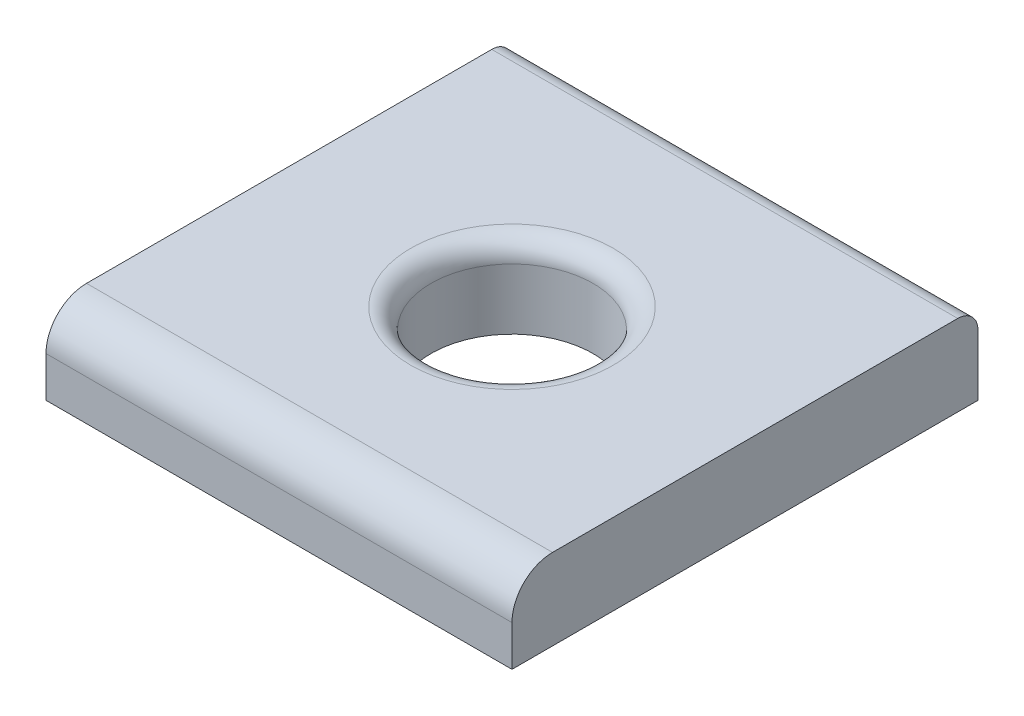
ISO-10303-21;
HEADER;
FILE_DESCRIPTION(('STEP AP214'),'2;1');
FILE_NAME('part.step','',(''),(''),'','','');
FILE_SCHEMA(('AUTOMOTIVE_DESIGN { 1 0 10303 214 1 1 1 1 }'));
ENDSEC;
DATA;
#1=APPLICATION_CONTEXT('core data for automotive mechanical design processes');
#2=APPLICATION_PROTOCOL_DEFINITION('international standard','automotive_design',2000,#1);
#3=PRODUCT_CONTEXT('',#1,'mechanical');
#4=PRODUCT('Part','Part','',(#3));
#5=PRODUCT_RELATED_PRODUCT_CATEGORY('part','',(#4));
#6=PRODUCT_DEFINITION_FORMATION('','',#4);
#7=PRODUCT_DEFINITION_CONTEXT('part definition',#1,'design');
#8=PRODUCT_DEFINITION('design','',#6,#7);
#9=PRODUCT_DEFINITION_SHAPE('','',#8);
#10=(LENGTH_UNIT() NAMED_UNIT(*) SI_UNIT(.MILLI.,.METRE.));
#11=(NAMED_UNIT(*) PLANE_ANGLE_UNIT() SI_UNIT($,.RADIAN.));
#12=(NAMED_UNIT(*) SI_UNIT($,.STERADIAN.) SOLID_ANGLE_UNIT());
#13=UNCERTAINTY_MEASURE_WITH_UNIT(LENGTH_MEASURE(1.E-05),#10,'distance_accuracy_value','');
#14=(GEOMETRIC_REPRESENTATION_CONTEXT(3) GLOBAL_UNCERTAINTY_ASSIGNED_CONTEXT((#13)) GLOBAL_UNIT_ASSIGNED_CONTEXT((#10,
#11,#12)) REPRESENTATION_CONTEXT('',''));
#15=CARTESIAN_POINT('',(0.,0.,0.));
#16=DIRECTION('',(0.,0.,1.));
#17=DIRECTION('',(1.,0.,0.));
#18=AXIS2_PLACEMENT_3D('',#15,#16,#17);
#19=CARTESIAN_POINT('',(5.75,2.,-5.75));
#20=DIRECTION('',(-1.,0.,0.));
#21=DIRECTION('',(0.,0.,1.));
#22=AXIS2_PLACEMENT_3D('',#19,#20,#21);
#23=PLANE('',#22);
#24=DIRECTION('',(0.,-1.,0.));
#25=VECTOR('',#24,1.);
#26=CARTESIAN_POINT('',(5.75,2.,-5.75));
#27=LINE('',#26,#25);
#28=CARTESIAN_POINT('',(5.75,1.5,-5.75));
#29=VERTEX_POINT('',#28);
#30=CARTESIAN_POINT('',(5.75,0.,-5.75));
#31=VERTEX_POINT('',#30);
#32=EDGE_CURVE('E85',#29,#31,#27,.T.);
#33=ORIENTED_EDGE('',*,*,#32,.F.);
#34=CARTESIAN_POINT('',(5.75,1.5,-5.25));
#35=DIRECTION('',(-1.,0.,0.));
#36=DIRECTION('',(0.,0.,1.));
#37=AXIS2_PLACEMENT_3D('',#34,#35,#36);
#38=CIRCLE('',#37,0.5);
#39=CARTESIAN_POINT('',(5.75,2.,-5.25));
#40=VERTEX_POINT('',#39);
#41=EDGE_CURVE('E137',#29,#40,#38,.F.);
#42=ORIENTED_EDGE('',*,*,#41,.T.);
#43=DIRECTION('',(0.,0.,-1.));
#44=VECTOR('',#43,1.);
#45=CARTESIAN_POINT('',(5.75,2.,-5.75));
#46=LINE('',#45,#44);
#47=CARTESIAN_POINT('',(5.75,2.,4.75));
#48=VERTEX_POINT('',#47);
#49=EDGE_CURVE('E118',#48,#40,#46,.T.);
#50=ORIENTED_EDGE('',*,*,#49,.F.);
#51=CARTESIAN_POINT('',(5.75,1.,4.75));
#52=DIRECTION('',(-1.,0.,0.));
#53=DIRECTION('',(0.,0.,1.));
#54=AXIS2_PLACEMENT_3D('',#51,#52,#53);
#55=CIRCLE('',#54,1.);
#56=CARTESIAN_POINT('',(5.75,1.,5.75));
#57=VERTEX_POINT('',#56);
#58=EDGE_CURVE('E125',#48,#57,#55,.F.);
#59=ORIENTED_EDGE('',*,*,#58,.T.);
#60=DIRECTION('',(0.,-1.,0.));
#61=VECTOR('',#60,1.);
#62=CARTESIAN_POINT('',(5.75,2.,5.75));
#63=LINE('',#62,#61);
#64=CARTESIAN_POINT('',(5.75,0.,5.75));
#65=VERTEX_POINT('',#64);
#66=EDGE_CURVE('E105',#57,#65,#63,.T.);
#67=ORIENTED_EDGE('',*,*,#66,.T.);
#68=DIRECTION('',(0.,0.,-1.));
#69=VECTOR('',#68,1.);
#70=CARTESIAN_POINT('',(5.75,0.,-5.75));
#71=LINE('',#70,#69);
#72=EDGE_CURVE('E100',#65,#31,#71,.T.);
#73=ORIENTED_EDGE('',*,*,#72,.T.);
#74=EDGE_LOOP('',(#33,#42,#50,#59,#67,#73));
#75=FACE_BOUND('',#74,.T.);
#76=ADVANCED_FACE('F34',(#75),#23,.F.);
#77=CARTESIAN_POINT('',(-5.75,2.,-5.75));
#78=DIRECTION('',(0.,0.,1.));
#79=DIRECTION('',(1.,0.,0.));
#80=AXIS2_PLACEMENT_3D('',#77,#78,#79);
#81=PLANE('',#80);
#82=DIRECTION('',(0.,-1.,0.));
#83=VECTOR('',#82,1.);
#84=CARTESIAN_POINT('',(-5.75,2.,-5.75));
#85=LINE('',#84,#83);
#86=CARTESIAN_POINT('',(-5.75,1.5,-5.75));
#87=VERTEX_POINT('',#86);
#88=CARTESIAN_POINT('',(-5.75,0.,-5.75));
#89=VERTEX_POINT('',#88);
#90=EDGE_CURVE('E94',#87,#89,#85,.T.);
#91=ORIENTED_EDGE('',*,*,#90,.F.);
#92=DIRECTION('',(-1.,0.,0.));
#93=VECTOR('',#92,1.);
#94=CARTESIAN_POINT('',(5.75,1.5,-5.75));
#95=LINE('',#94,#93);
#96=EDGE_CURVE('E49',#87,#29,#95,.F.);
#97=ORIENTED_EDGE('',*,*,#96,.T.);
#98=ORIENTED_EDGE('',*,*,#32,.T.);
#99=DIRECTION('',(-1.,0.,0.));
#100=VECTOR('',#99,1.);
#101=CARTESIAN_POINT('',(-5.75,0.,-5.75));
#102=LINE('',#101,#100);
#103=EDGE_CURVE('E88',#31,#89,#102,.T.);
#104=ORIENTED_EDGE('',*,*,#103,.T.);
#105=EDGE_LOOP('',(#91,#97,#98,#104));
#106=FACE_BOUND('',#105,.T.);
#107=ADVANCED_FACE('F87',(#106),#81,.F.);
#108=CARTESIAN_POINT('',(-5.75,2.,-5.75));
#109=DIRECTION('',(1.,0.,0.));
#110=DIRECTION('',(0.,0.,-1.));
#111=AXIS2_PLACEMENT_3D('',#108,#109,#110);
#112=PLANE('',#111);
#113=DIRECTION('',(0.,0.,1.));
#114=VECTOR('',#113,1.);
#115=CARTESIAN_POINT('',(-5.75,2.,-5.75));
#116=LINE('',#115,#114);
#117=CARTESIAN_POINT('',(-5.75,2.,-5.25));
#118=VERTEX_POINT('',#117);
#119=CARTESIAN_POINT('',(-5.75,2.,4.75));
#120=VERTEX_POINT('',#119);
#121=EDGE_CURVE('E112',#118,#120,#116,.T.);
#122=ORIENTED_EDGE('',*,*,#121,.F.);
#123=CARTESIAN_POINT('',(-5.75,1.5,-5.25));
#124=DIRECTION('',(1.,0.,0.));
#125=DIRECTION('',(0.,0.,-1.));
#126=AXIS2_PLACEMENT_3D('',#123,#124,#125);
#127=CIRCLE('',#126,0.5);
#128=EDGE_CURVE('E57',#118,#87,#127,.F.);
#129=ORIENTED_EDGE('',*,*,#128,.T.);
#130=ORIENTED_EDGE('',*,*,#90,.T.);
#131=DIRECTION('',(0.,0.,1.));
#132=VECTOR('',#131,1.);
#133=CARTESIAN_POINT('',(-5.75,0.,-5.75));
#134=LINE('',#133,#132);
#135=CARTESIAN_POINT('',(-5.75,0.,5.75));
#136=VERTEX_POINT('',#135);
#137=EDGE_CURVE('E102',#89,#136,#134,.T.);
#138=ORIENTED_EDGE('',*,*,#137,.T.);
#139=DIRECTION('',(0.,-1.,0.));
#140=VECTOR('',#139,1.);
#141=CARTESIAN_POINT('',(-5.75,2.,5.75));
#142=LINE('',#141,#140);
#143=CARTESIAN_POINT('',(-5.75,1.,5.75));
#144=VERTEX_POINT('',#143);
#145=EDGE_CURVE('E120',#144,#136,#142,.T.);
#146=ORIENTED_EDGE('',*,*,#145,.F.);
#147=CARTESIAN_POINT('',(-5.75,1.,4.75));
#148=DIRECTION('',(1.,0.,0.));
#149=DIRECTION('',(0.,0.,-1.));
#150=AXIS2_PLACEMENT_3D('',#147,#148,#149);
#151=CIRCLE('',#150,1.);
#152=EDGE_CURVE('E129',#144,#120,#151,.F.);
#153=ORIENTED_EDGE('',*,*,#152,.T.);
#154=EDGE_LOOP('',(#122,#129,#130,#138,#146,#153));
#155=FACE_BOUND('',#154,.T.);
#156=ADVANCED_FACE('F158',(#155),#112,.F.);
#157=CARTESIAN_POINT('',(-5.75,2.,5.75));
#158=DIRECTION('',(0.,0.,-1.));
#159=DIRECTION('',(-1.,0.,0.));
#160=AXIS2_PLACEMENT_3D('',#157,#158,#159);
#161=PLANE('',#160);
#162=ORIENTED_EDGE('',*,*,#66,.F.);
#163=DIRECTION('',(1.,0.,0.));
#164=VECTOR('',#163,1.);
#165=CARTESIAN_POINT('',(-5.75,1.,5.75));
#166=LINE('',#165,#164);
#167=EDGE_CURVE('E127',#57,#144,#166,.F.);
#168=ORIENTED_EDGE('',*,*,#167,.T.);
#169=ORIENTED_EDGE('',*,*,#145,.T.);
#170=DIRECTION('',(1.,0.,0.));
#171=VECTOR('',#170,1.);
#172=CARTESIAN_POINT('',(-5.75,0.,5.75));
#173=LINE('',#172,#171);
#174=EDGE_CURVE('E116',#136,#65,#173,.T.);
#175=ORIENTED_EDGE('',*,*,#174,.T.);
#176=EDGE_LOOP('',(#162,#168,#169,#175));
#177=FACE_BOUND('',#176,.T.);
#178=ADVANCED_FACE('F173',(#177),#161,.F.);
#179=CARTESIAN_POINT('',(0.,2.,0.));
#180=DIRECTION('',(0.,1.,0.));
#181=DIRECTION('',(0.,0.,1.));
#182=AXIS2_PLACEMENT_3D('',#179,#180,#181);
#183=PLANE('',#182);
#184=CARTESIAN_POINT('',(0.,2.,0.));
#185=DIRECTION('',(0.,1.,0.));
#186=DIRECTION('',(0.,0.,1.));
#187=AXIS2_PLACEMENT_3D('',#184,#185,#186);
#188=CIRCLE('',#187,2.5);
#189=CARTESIAN_POINT('',(0.,2.,2.5));
#190=VERTEX_POINT('',#189);
#191=EDGE_CURVE('E11',#190,#190,#188,.F.);
#192=ORIENTED_EDGE('',*,*,#191,.T.);
#193=EDGE_LOOP('',(#192));
#194=FACE_BOUND('',#193,.T.);
#195=ORIENTED_EDGE('',*,*,#49,.T.);
#196=DIRECTION('',(-1.,0.,0.));
#197=VECTOR('',#196,1.);
#198=CARTESIAN_POINT('',(-5.75,2.,-5.25));
#199=LINE('',#198,#197);
#200=EDGE_CURVE('E132',#40,#118,#199,.T.);
#201=ORIENTED_EDGE('',*,*,#200,.T.);
#202=ORIENTED_EDGE('',*,*,#121,.T.);
#203=DIRECTION('',(1.,0.,0.));
#204=VECTOR('',#203,1.);
#205=CARTESIAN_POINT('',(5.75,2.,4.75));
#206=LINE('',#205,#204);
#207=EDGE_CURVE('E93',#120,#48,#206,.T.);
#208=ORIENTED_EDGE('',*,*,#207,.T.);
#209=EDGE_LOOP('',(#195,#201,#202,#208));
#210=FACE_BOUND('',#209,.T.);
#211=ADVANCED_FACE('F175',(#194,#210),#183,.T.);
#212=CARTESIAN_POINT('',(0.,0.,0.));
#213=DIRECTION('',(0.,1.,0.));
#214=DIRECTION('',(0.,0.,1.));
#215=AXIS2_PLACEMENT_3D('',#212,#213,#214);
#216=PLANE('',#215);
#217=CARTESIAN_POINT('',(0.,0.,0.));
#218=DIRECTION('',(0.,1.,0.));
#219=DIRECTION('',(0.,0.,1.));
#220=AXIS2_PLACEMENT_3D('',#217,#218,#219);
#221=CIRCLE('',#220,2.);
#222=CARTESIAN_POINT('',(0.,0.,2.));
#223=VERTEX_POINT('',#222);
#224=EDGE_CURVE('E107',#223,#223,#221,.T.);
#225=ORIENTED_EDGE('',*,*,#224,.T.);
#226=EDGE_LOOP('',(#225));
#227=FACE_BOUND('',#226,.T.);
#228=ORIENTED_EDGE('',*,*,#72,.F.);
#229=ORIENTED_EDGE('',*,*,#174,.F.);
#230=ORIENTED_EDGE('',*,*,#137,.F.);
#231=ORIENTED_EDGE('',*,*,#103,.F.);
#232=EDGE_LOOP('',(#228,#229,#230,#231));
#233=FACE_BOUND('',#232,.T.);
#234=ADVANCED_FACE('F98',(#227,#233),#216,.F.);
#235=CARTESIAN_POINT('',(0.,0.,0.));
#236=DIRECTION('',(0.,1.,0.));
#237=DIRECTION('',(0.,0.,1.));
#238=AXIS2_PLACEMENT_3D('',#235,#236,#237);
#239=CYLINDRICAL_SURFACE('',#238,2.);
#240=CARTESIAN_POINT('',(0.,1.5,0.));
#241=DIRECTION('',(0.,1.,0.));
#242=DIRECTION('',(0.,0.,1.));
#243=AXIS2_PLACEMENT_3D('',#240,#241,#242);
#244=CIRCLE('',#243,2.);
#245=CARTESIAN_POINT('',(0.,1.5,2.));
#246=VERTEX_POINT('',#245);
#247=EDGE_CURVE('E42',#246,#246,#244,.T.);
#248=ORIENTED_EDGE('',*,*,#247,.T.);
#249=EDGE_LOOP('',(#248));
#250=FACE_BOUND('',#249,.T.);
#251=ORIENTED_EDGE('',*,*,#224,.F.);
#252=EDGE_LOOP('',(#251));
#253=FACE_BOUND('',#252,.T.);
#254=ADVANCED_FACE('F141',(#250,#253),#239,.F.);
#255=CARTESIAN_POINT('',(0.,1.,4.75));
#256=DIRECTION('',(-1.,0.,0.));
#257=DIRECTION('',(0.,0.,1.));
#258=AXIS2_PLACEMENT_3D('',#255,#256,#257);
#259=CYLINDRICAL_SURFACE('',#258,1.);
#260=ORIENTED_EDGE('',*,*,#152,.F.);
#261=ORIENTED_EDGE('',*,*,#167,.F.);
#262=ORIENTED_EDGE('',*,*,#58,.F.);
#263=ORIENTED_EDGE('',*,*,#207,.F.);
#264=EDGE_LOOP('',(#260,#261,#262,#263));
#265=FACE_BOUND('',#264,.T.);
#266=ADVANCED_FACE('F150',(#265),#259,.T.);
#267=CARTESIAN_POINT('',(0.,1.5,-5.25));
#268=DIRECTION('',(1.,0.,0.));
#269=DIRECTION('',(0.,0.,-1.));
#270=AXIS2_PLACEMENT_3D('',#267,#268,#269);
#271=CYLINDRICAL_SURFACE('',#270,0.5);
#272=ORIENTED_EDGE('',*,*,#41,.F.);
#273=ORIENTED_EDGE('',*,*,#96,.F.);
#274=ORIENTED_EDGE('',*,*,#128,.F.);
#275=ORIENTED_EDGE('',*,*,#200,.F.);
#276=EDGE_LOOP('',(#272,#273,#274,#275));
#277=FACE_BOUND('',#276,.T.);
#278=ADVANCED_FACE('F145',(#277),#271,.T.);
#279=CARTESIAN_POINT('',(0.,1.5,0.));
#280=DIRECTION('',(0.,1.,0.));
#281=DIRECTION('',(0.,0.,1.));
#282=AXIS2_PLACEMENT_3D('',#279,#280,#281);
#283=TOROIDAL_SURFACE('',#282,2.5,0.5);
#284=ORIENTED_EDGE('',*,*,#191,.F.);
#285=EDGE_LOOP('',(#284));
#286=FACE_BOUND('',#285,.T.);
#287=ORIENTED_EDGE('',*,*,#247,.F.);
#288=EDGE_LOOP('',(#287));
#289=FACE_BOUND('',#288,.T.);
#290=ADVANCED_FACE('F36',(#286,#289),#283,.T.);
#291=CLOSED_SHELL('',(#76,#107,#156,#178,#211,#234,#254,#266,#278,#290));
#292=MANIFOLD_SOLID_BREP('B2',#291);
#293=ADVANCED_BREP_SHAPE_REPRESENTATION('',(#18,#292),#14);
#294=SHAPE_DEFINITION_REPRESENTATION(#9,#293);
ENDSEC;
END-ISO-10303-21;
